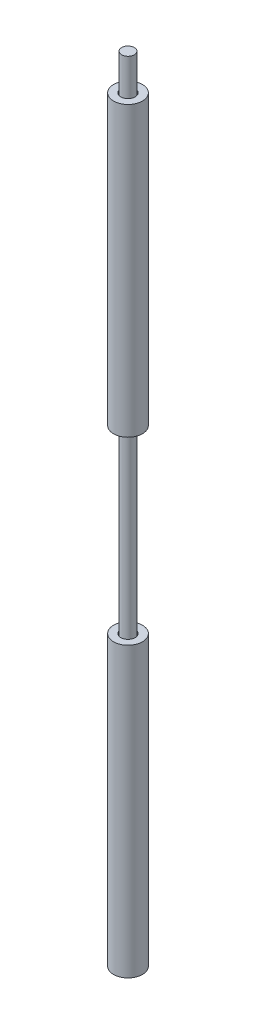
ISO-10303-21;
HEADER;
FILE_DESCRIPTION(('STEP AP214'),'2;1');
FILE_NAME('part.step','',(''),(''),'','','');
FILE_SCHEMA(('AUTOMOTIVE_DESIGN { 1 0 10303 214 1 1 1 1 }'));
ENDSEC;
DATA;
#1=APPLICATION_CONTEXT('core data for automotive mechanical design processes');
#2=APPLICATION_PROTOCOL_DEFINITION('international standard','automotive_design',2000,#1);
#3=PRODUCT_CONTEXT('',#1,'mechanical');
#4=PRODUCT('Part','Part','',(#3));
#5=PRODUCT_RELATED_PRODUCT_CATEGORY('part','',(#4));
#6=PRODUCT_DEFINITION_FORMATION('','',#4);
#7=PRODUCT_DEFINITION_CONTEXT('part definition',#1,'design');
#8=PRODUCT_DEFINITION('design','',#6,#7);
#9=PRODUCT_DEFINITION_SHAPE('','',#8);
#10=(LENGTH_UNIT() NAMED_UNIT(*) SI_UNIT(.MILLI.,.METRE.));
#11=(NAMED_UNIT(*) PLANE_ANGLE_UNIT() SI_UNIT($,.RADIAN.));
#12=(NAMED_UNIT(*) SI_UNIT($,.STERADIAN.) SOLID_ANGLE_UNIT());
#13=UNCERTAINTY_MEASURE_WITH_UNIT(LENGTH_MEASURE(1.E-05),#10,'distance_accuracy_value','');
#14=(GEOMETRIC_REPRESENTATION_CONTEXT(3) GLOBAL_UNCERTAINTY_ASSIGNED_CONTEXT((#13)) GLOBAL_UNIT_ASSIGNED_CONTEXT((#10,
#11,#12)) REPRESENTATION_CONTEXT('',''));
#15=CARTESIAN_POINT('',(0.,0.,0.));
#16=DIRECTION('',(0.,0.,1.));
#17=DIRECTION('',(1.,0.,0.));
#18=AXIS2_PLACEMENT_3D('',#15,#16,#17);
#19=CARTESIAN_POINT('',(0.,-25.,0.));
#20=DIRECTION('',(0.,1.,0.));
#21=DIRECTION('',(0.,0.,1.));
#22=AXIS2_PLACEMENT_3D('',#19,#20,#21);
#23=PLANE('',#22);
#24=CARTESIAN_POINT('',(0.,-25.,0.));
#25=DIRECTION('',(0.,1.,0.));
#26=DIRECTION('',(0.,0.,1.));
#27=AXIS2_PLACEMENT_3D('',#24,#25,#26);
#28=CIRCLE('',#27,2.);
#29=CARTESIAN_POINT('',(0.,-25.,2.));
#30=VERTEX_POINT('',#29);
#31=EDGE_CURVE('P0_E10',#30,#30,#28,.T.);
#32=ORIENTED_EDGE('',*,*,#31,.T.);
#33=EDGE_LOOP('',(#32));
#34=FACE_BOUND('',#33,.T.);
#35=CARTESIAN_POINT('',(0.,-25.,0.));
#36=DIRECTION('',(0.,1.,0.));
#37=DIRECTION('',(0.,0.,1.));
#38=AXIS2_PLACEMENT_3D('',#35,#36,#37);
#39=CIRCLE('',#38,1.);
#40=CARTESIAN_POINT('',(0.,-25.,1.));
#41=VERTEX_POINT('',#40);
#42=EDGE_CURVE('P0_E25',#41,#41,#39,.T.);
#43=ORIENTED_EDGE('',*,*,#42,.F.);
#44=EDGE_LOOP('',(#43));
#45=FACE_BOUND('',#44,.T.);
#46=ADVANCED_FACE('P0_F14',(#34,#45),#23,.T.);
#47=CARTESIAN_POINT('',(0.,-65.,0.));
#48=DIRECTION('',(0.,1.,0.));
#49=DIRECTION('',(0.,0.,1.));
#50=AXIS2_PLACEMENT_3D('',#47,#48,#49);
#51=PLANE('',#50);
#52=CARTESIAN_POINT('',(0.,-65.,0.));
#53=DIRECTION('',(0.,1.,0.));
#54=DIRECTION('',(0.,0.,1.));
#55=AXIS2_PLACEMENT_3D('',#52,#53,#54);
#56=CIRCLE('',#55,2.);
#57=CARTESIAN_POINT('',(0.,-65.,2.));
#58=VERTEX_POINT('',#57);
#59=EDGE_CURVE('P0_E18',#58,#58,#56,.T.);
#60=ORIENTED_EDGE('',*,*,#59,.F.);
#61=EDGE_LOOP('',(#60));
#62=FACE_BOUND('',#61,.T.);
#63=CARTESIAN_POINT('',(0.,-65.,0.));
#64=DIRECTION('',(0.,1.,0.));
#65=DIRECTION('',(0.,0.,1.));
#66=AXIS2_PLACEMENT_3D('',#63,#64,#65);
#67=CIRCLE('',#66,1.);
#68=CARTESIAN_POINT('',(0.,-65.,1.));
#69=VERTEX_POINT('',#68);
#70=EDGE_CURVE('P0_E27',#69,#69,#67,.T.);
#71=ORIENTED_EDGE('',*,*,#70,.T.);
#72=EDGE_LOOP('',(#71));
#73=FACE_BOUND('',#72,.T.);
#74=ADVANCED_FACE('P0_F41',(#62,#73),#51,.F.);
#75=CARTESIAN_POINT('',(0.,-25.,0.));
#76=DIRECTION('',(0.,-1.,0.));
#77=DIRECTION('',(0.,0.,-1.));
#78=AXIS2_PLACEMENT_3D('',#75,#76,#77);
#79=CYLINDRICAL_SURFACE('',#78,2.);
#80=ORIENTED_EDGE('',*,*,#31,.F.);
#81=EDGE_LOOP('',(#80));
#82=FACE_BOUND('',#81,.T.);
#83=ORIENTED_EDGE('',*,*,#59,.T.);
#84=EDGE_LOOP('',(#83));
#85=FACE_BOUND('',#84,.T.);
#86=ADVANCED_FACE('P0_F16',(#82,#85),#79,.T.);
#87=CARTESIAN_POINT('',(0.,-25.,0.));
#88=DIRECTION('',(0.,-1.,0.));
#89=DIRECTION('',(0.,0.,-1.));
#90=AXIS2_PLACEMENT_3D('',#87,#88,#89);
#91=CYLINDRICAL_SURFACE('',#90,1.);
#92=ORIENTED_EDGE('',*,*,#42,.T.);
#93=EDGE_LOOP('',(#92));
#94=FACE_BOUND('',#93,.T.);
#95=ORIENTED_EDGE('',*,*,#70,.F.);
#96=EDGE_LOOP('',(#95));
#97=FACE_BOUND('',#96,.T.);
#98=ADVANCED_FACE('P0_F37',(#94,#97),#91,.F.);
#99=CLOSED_SHELL('',(#46,#74,#86,#98));
#100=MANIFOLD_SOLID_BREP('P0_B1',#99);
#101=CARTESIAN_POINT('',(0.,45.,0.));
#102=DIRECTION('',(0.,-1.,0.));
#103=DIRECTION('',(0.,0.,-1.));
#104=AXIS2_PLACEMENT_3D('',#101,#102,#103);
#105=CYLINDRICAL_SURFACE('',#104,0.875);
#106=CARTESIAN_POINT('',(0.,45.,0.));
#107=DIRECTION('',(0.,-1.,0.));
#108=DIRECTION('',(0.,0.,-1.));
#109=AXIS2_PLACEMENT_3D('',#106,#107,#108);
#110=CIRCLE('',#109,0.875);
#111=CARTESIAN_POINT('',(0.,45.,-0.875));
#112=VERTEX_POINT('',#111);
#113=EDGE_CURVE('P1_E10',#112,#112,#110,.T.);
#114=ORIENTED_EDGE('',*,*,#113,.T.);
#115=EDGE_LOOP('',(#114));
#116=FACE_BOUND('',#115,.T.);
#117=CARTESIAN_POINT('',(0.,-60.,0.));
#118=DIRECTION('',(0.,-1.,0.));
#119=DIRECTION('',(0.,0.,-1.));
#120=AXIS2_PLACEMENT_3D('',#117,#118,#119);
#121=CIRCLE('',#120,0.875);
#122=CARTESIAN_POINT('',(0.,-60.,-0.875));
#123=VERTEX_POINT('',#122);
#124=EDGE_CURVE('P1_E20',#123,#123,#121,.T.);
#125=ORIENTED_EDGE('',*,*,#124,.F.);
#126=EDGE_LOOP('',(#125));
#127=FACE_BOUND('',#126,.T.);
#128=ADVANCED_FACE('P1_F14',(#116,#127),#105,.T.);
#129=CARTESIAN_POINT('',(0.,45.,0.));
#130=DIRECTION('',(0.,-1.,0.));
#131=DIRECTION('',(0.,0.,-1.));
#132=AXIS2_PLACEMENT_3D('',#129,#130,#131);
#133=PLANE('',#132);
#134=ORIENTED_EDGE('',*,*,#113,.F.);
#135=EDGE_LOOP('',(#134));
#136=FACE_BOUND('',#135,.T.);
#137=ADVANCED_FACE('P1_F29',(#136),#133,.F.);
#138=CARTESIAN_POINT('',(0.,-60.,0.));
#139=DIRECTION('',(0.,-1.,0.));
#140=DIRECTION('',(0.,0.,-1.));
#141=AXIS2_PLACEMENT_3D('',#138,#139,#140);
#142=PLANE('',#141);
#143=ORIENTED_EDGE('',*,*,#124,.T.);
#144=EDGE_LOOP('',(#143));
#145=FACE_BOUND('',#144,.T.);
#146=ADVANCED_FACE('P1_F26',(#145),#142,.T.);
#147=CLOSED_SHELL('',(#128,#137,#146));
#148=MANIFOLD_SOLID_BREP('P1_B1',#147);
#149=CARTESIAN_POINT('',(0.,40.,0.));
#150=DIRECTION('',(0.,1.,0.));
#151=DIRECTION('',(0.,0.,1.));
#152=AXIS2_PLACEMENT_3D('',#149,#150,#151);
#153=PLANE('',#152);
#154=CARTESIAN_POINT('',(0.,40.,0.));
#155=DIRECTION('',(0.,1.,0.));
#156=DIRECTION('',(0.,0.,1.));
#157=AXIS2_PLACEMENT_3D('',#154,#155,#156);
#158=CIRCLE('',#157,2.);
#159=CARTESIAN_POINT('',(0.,40.,2.));
#160=VERTEX_POINT('',#159);
#161=EDGE_CURVE('P2_E10',#160,#160,#158,.T.);
#162=ORIENTED_EDGE('',*,*,#161,.T.);
#163=EDGE_LOOP('',(#162));
#164=FACE_BOUND('',#163,.T.);
#165=CARTESIAN_POINT('',(0.,40.,0.));
#166=DIRECTION('',(0.,1.,0.));
#167=DIRECTION('',(0.,0.,1.));
#168=AXIS2_PLACEMENT_3D('',#165,#166,#167);
#169=CIRCLE('',#168,1.);
#170=CARTESIAN_POINT('',(0.,40.,1.));
#171=VERTEX_POINT('',#170);
#172=EDGE_CURVE('P2_E25',#171,#171,#169,.T.);
#173=ORIENTED_EDGE('',*,*,#172,.F.);
#174=EDGE_LOOP('',(#173));
#175=FACE_BOUND('',#174,.T.);
#176=ADVANCED_FACE('P2_F14',(#164,#175),#153,.T.);
#177=CARTESIAN_POINT('',(0.,0.,0.));
#178=DIRECTION('',(0.,1.,0.));
#179=DIRECTION('',(0.,0.,1.));
#180=AXIS2_PLACEMENT_3D('',#177,#178,#179);
#181=PLANE('',#180);
#182=CARTESIAN_POINT('',(0.,0.,0.));
#183=DIRECTION('',(0.,1.,0.));
#184=DIRECTION('',(0.,0.,1.));
#185=AXIS2_PLACEMENT_3D('',#182,#183,#184);
#186=CIRCLE('',#185,2.);
#187=CARTESIAN_POINT('',(0.,0.,2.));
#188=VERTEX_POINT('',#187);
#189=EDGE_CURVE('P2_E18',#188,#188,#186,.T.);
#190=ORIENTED_EDGE('',*,*,#189,.F.);
#191=EDGE_LOOP('',(#190));
#192=FACE_BOUND('',#191,.T.);
#193=CARTESIAN_POINT('',(0.,0.,0.));
#194=DIRECTION('',(0.,1.,0.));
#195=DIRECTION('',(0.,0.,1.));
#196=AXIS2_PLACEMENT_3D('',#193,#194,#195);
#197=CIRCLE('',#196,1.);
#198=CARTESIAN_POINT('',(0.,0.,1.));
#199=VERTEX_POINT('',#198);
#200=EDGE_CURVE('P2_E27',#199,#199,#197,.T.);
#201=ORIENTED_EDGE('',*,*,#200,.T.);
#202=EDGE_LOOP('',(#201));
#203=FACE_BOUND('',#202,.T.);
#204=ADVANCED_FACE('P2_F37',(#192,#203),#181,.F.);
#205=CARTESIAN_POINT('',(0.,40.,0.));
#206=DIRECTION('',(0.,-1.,0.));
#207=DIRECTION('',(0.,0.,-1.));
#208=AXIS2_PLACEMENT_3D('',#205,#206,#207);
#209=CYLINDRICAL_SURFACE('',#208,2.);
#210=ORIENTED_EDGE('',*,*,#161,.F.);
#211=EDGE_LOOP('',(#210));
#212=FACE_BOUND('',#211,.T.);
#213=ORIENTED_EDGE('',*,*,#189,.T.);
#214=EDGE_LOOP('',(#213));
#215=FACE_BOUND('',#214,.T.);
#216=ADVANCED_FACE('P2_F16',(#212,#215),#209,.T.);
#217=CARTESIAN_POINT('',(0.,40.,0.));
#218=DIRECTION('',(0.,-1.,0.));
#219=DIRECTION('',(0.,0.,-1.));
#220=AXIS2_PLACEMENT_3D('',#217,#218,#219);
#221=CYLINDRICAL_SURFACE('',#220,1.);
#222=ORIENTED_EDGE('',*,*,#172,.T.);
#223=EDGE_LOOP('',(#222));
#224=FACE_BOUND('',#223,.T.);
#225=ORIENTED_EDGE('',*,*,#200,.F.);
#226=EDGE_LOOP('',(#225));
#227=FACE_BOUND('',#226,.T.);
#228=ADVANCED_FACE('P2_F33',(#224,#227),#221,.F.);
#229=CLOSED_SHELL('',(#176,#204,#216,#228));
#230=MANIFOLD_SOLID_BREP('P2_B1',#229);
#231=ADVANCED_BREP_SHAPE_REPRESENTATION('',(#18,#100,#148,#230),#14);
#232=SHAPE_DEFINITION_REPRESENTATION(#9,#231);
ENDSEC;
END-ISO-10303-21;
